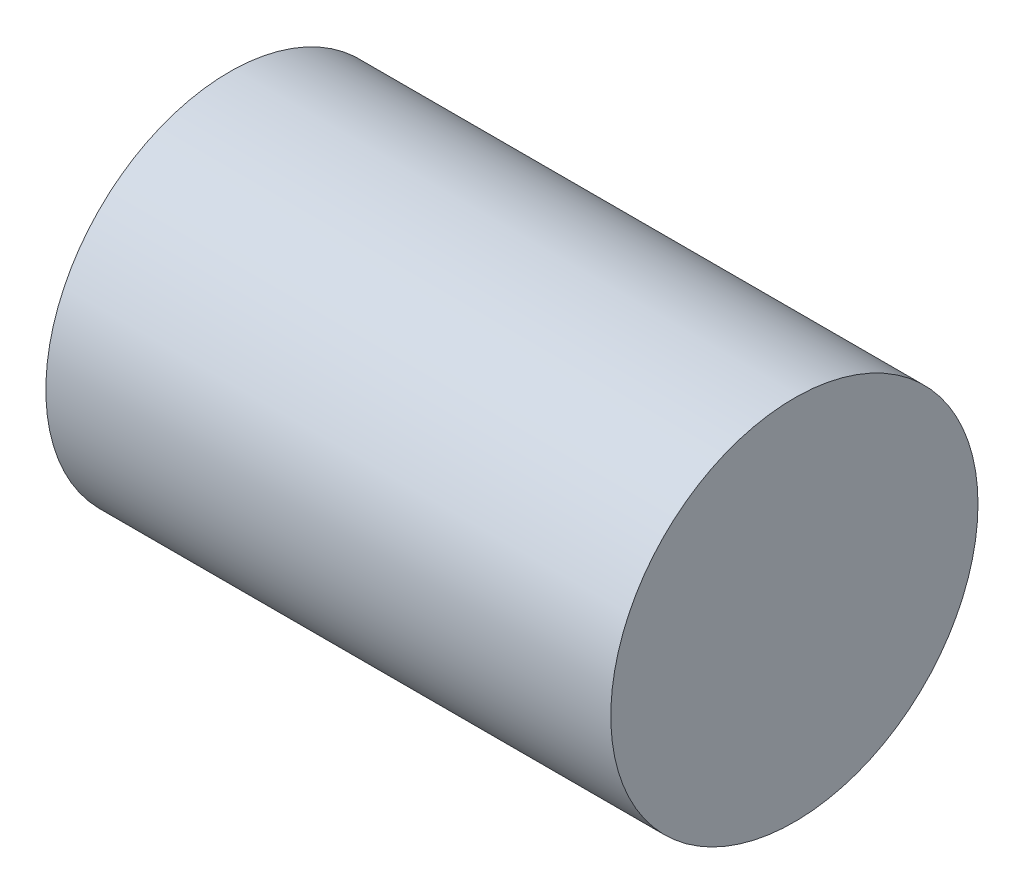
ISO-10303-21;
HEADER;
FILE_DESCRIPTION(('STEP AP214'),'2;1');
FILE_NAME('part.step','',(''),(''),'','','');
FILE_SCHEMA(('AUTOMOTIVE_DESIGN { 1 0 10303 214 1 1 1 1 }'));
ENDSEC;
DATA;
#1=APPLICATION_CONTEXT('core data for automotive mechanical design processes');
#2=APPLICATION_PROTOCOL_DEFINITION('international standard','automotive_design',2000,#1);
#3=PRODUCT_CONTEXT('',#1,'mechanical');
#4=PRODUCT('Part','Part','',(#3));
#5=PRODUCT_RELATED_PRODUCT_CATEGORY('part','',(#4));
#6=PRODUCT_DEFINITION_FORMATION('','',#4);
#7=PRODUCT_DEFINITION_CONTEXT('part definition',#1,'design');
#8=PRODUCT_DEFINITION('design','',#6,#7);
#9=PRODUCT_DEFINITION_SHAPE('','',#8);
#10=(LENGTH_UNIT() NAMED_UNIT(*) SI_UNIT(.MILLI.,.METRE.));
#11=(NAMED_UNIT(*) PLANE_ANGLE_UNIT() SI_UNIT($,.RADIAN.));
#12=(NAMED_UNIT(*) SI_UNIT($,.STERADIAN.) SOLID_ANGLE_UNIT());
#13=UNCERTAINTY_MEASURE_WITH_UNIT(LENGTH_MEASURE(1.E-05),#10,'distance_accuracy_value','');
#14=(GEOMETRIC_REPRESENTATION_CONTEXT(3) GLOBAL_UNCERTAINTY_ASSIGNED_CONTEXT((#13)) GLOBAL_UNIT_ASSIGNED_CONTEXT((#10,
#11,#12)) REPRESENTATION_CONTEXT('',''));
#15=CARTESIAN_POINT('',(0.,0.,0.));
#16=DIRECTION('',(0.,0.,1.));
#17=DIRECTION('',(1.,0.,0.));
#18=AXIS2_PLACEMENT_3D('',#15,#16,#17);
#19=CARTESIAN_POINT('',(60.,0.,0.));
#20=DIRECTION('',(-1.,0.,0.));
#21=DIRECTION('',(0.,0.,1.));
#22=AXIS2_PLACEMENT_3D('',#19,#20,#21);
#23=CYLINDRICAL_SURFACE('',#22,19.5);
#24=CARTESIAN_POINT('',(60.,0.,0.));
#25=DIRECTION('',(1.,0.,0.));
#26=DIRECTION('',(0.,0.,-1.));
#27=AXIS2_PLACEMENT_3D('',#24,#25,#26);
#28=CIRCLE('',#27,19.5);
#29=CARTESIAN_POINT('',(60.,0.,-19.5));
#30=VERTEX_POINT('',#29);
#31=EDGE_CURVE('E10',#30,#30,#28,.T.);
#32=ORIENTED_EDGE('',*,*,#31,.F.);
#33=EDGE_LOOP('',(#32));
#34=FACE_BOUND('',#33,.T.);
#35=CARTESIAN_POINT('',(0.,0.,0.));
#36=DIRECTION('',(1.,0.,0.));
#37=DIRECTION('',(0.,0.,-1.));
#38=AXIS2_PLACEMENT_3D('',#35,#36,#37);
#39=CIRCLE('',#38,19.5);
#40=CARTESIAN_POINT('',(0.,0.,-19.5));
#41=VERTEX_POINT('',#40);
#42=EDGE_CURVE('E34',#41,#41,#39,.T.);
#43=ORIENTED_EDGE('',*,*,#42,.T.);
#44=EDGE_LOOP('',(#43));
#45=FACE_BOUND('',#44,.T.);
#46=ADVANCED_FACE('F31',(#34,#45),#23,.T.);
#47=CARTESIAN_POINT('',(60.,0.,0.));
#48=DIRECTION('',(1.,0.,0.));
#49=DIRECTION('',(0.,0.,-1.));
#50=AXIS2_PLACEMENT_3D('',#47,#48,#49);
#51=PLANE('',#50);
#52=ORIENTED_EDGE('',*,*,#31,.T.);
#53=EDGE_LOOP('',(#52));
#54=FACE_BOUND('',#53,.T.);
#55=ADVANCED_FACE('F46',(#54),#51,.T.);
#56=CARTESIAN_POINT('',(0.,0.,0.));
#57=DIRECTION('',(1.,0.,0.));
#58=DIRECTION('',(0.,0.,-1.));
#59=AXIS2_PLACEMENT_3D('',#56,#57,#58);
#60=PLANE('',#59);
#61=ORIENTED_EDGE('',*,*,#42,.F.);
#62=EDGE_LOOP('',(#61));
#63=FACE_BOUND('',#62,.T.);
#64=ADVANCED_FACE('F44',(#63),#60,.F.);
#65=CLOSED_SHELL('',(#46,#55,#64));
#66=MANIFOLD_SOLID_BREP('B2',#65);
#67=ADVANCED_BREP_SHAPE_REPRESENTATION('',(#18,#66),#14);
#68=SHAPE_DEFINITION_REPRESENTATION(#9,#67);
ENDSEC;
END-ISO-10303-21;
